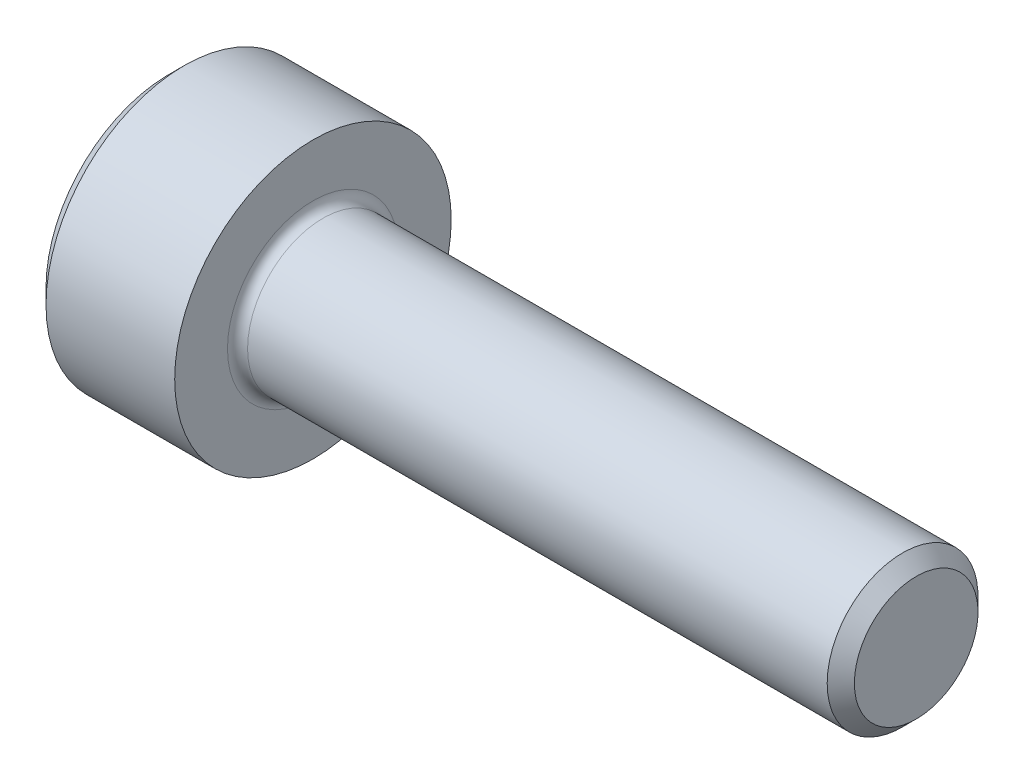
ISO-10303-21;
HEADER;
FILE_DESCRIPTION(('STEP AP214'),'2;1');
FILE_NAME('part.step','',(''),(''),'','','');
FILE_SCHEMA(('AUTOMOTIVE_DESIGN { 1 0 10303 214 1 1 1 1 }'));
ENDSEC;
DATA;
#1=APPLICATION_CONTEXT('core data for automotive mechanical design processes');
#2=APPLICATION_PROTOCOL_DEFINITION('international standard','automotive_design',2000,#1);
#3=PRODUCT_CONTEXT('',#1,'mechanical');
#4=PRODUCT('Part','Part','',(#3));
#5=PRODUCT_RELATED_PRODUCT_CATEGORY('part','',(#4));
#6=PRODUCT_DEFINITION_FORMATION('','',#4);
#7=PRODUCT_DEFINITION_CONTEXT('part definition',#1,'design');
#8=PRODUCT_DEFINITION('design','',#6,#7);
#9=PRODUCT_DEFINITION_SHAPE('','',#8);
#10=(LENGTH_UNIT() NAMED_UNIT(*) SI_UNIT(.MILLI.,.METRE.));
#11=(NAMED_UNIT(*) PLANE_ANGLE_UNIT() SI_UNIT($,.RADIAN.));
#12=(NAMED_UNIT(*) SI_UNIT($,.STERADIAN.) SOLID_ANGLE_UNIT());
#13=UNCERTAINTY_MEASURE_WITH_UNIT(LENGTH_MEASURE(1.E-05),#10,'distance_accuracy_value','');
#14=(GEOMETRIC_REPRESENTATION_CONTEXT(3) GLOBAL_UNCERTAINTY_ASSIGNED_CONTEXT((#13)) GLOBAL_UNIT_ASSIGNED_CONTEXT((#10,
#11,#12)) REPRESENTATION_CONTEXT('',''));
#15=CARTESIAN_POINT('',(0.,0.,0.));
#16=DIRECTION('',(0.,0.,1.));
#17=DIRECTION('',(1.,0.,0.));
#18=AXIS2_PLACEMENT_3D('',#15,#16,#17);
#19=CARTESIAN_POINT('',(-1.56,0.72168783648703,1.25));
#20=DIRECTION('',(1.,0.,0.));
#21=DIRECTION('',(0.,0.,-1.));
#22=AXIS2_PLACEMENT_3D('',#19,#20,#21);
#23=PLANE('',#22);
#24=CARTESIAN_POINT('',(-1.56,0.,0.));
#25=DIRECTION('',(-1.,0.,0.));
#26=DIRECTION('',(0.,0.,1.));
#27=AXIS2_PLACEMENT_3D('',#24,#25,#26);
#28=CIRCLE('',#27,1.25);
#29=CARTESIAN_POINT('',(-1.56,0.,1.25));
#30=VERTEX_POINT('',#29);
#31=CARTESIAN_POINT('',(-1.56,1.08253175473053,0.625000000000025));
#32=VERTEX_POINT('',#31);
#33=EDGE_CURVE('E42',#30,#32,#28,.T.);
#34=ORIENTED_EDGE('',*,*,#33,.F.);
#35=DIRECTION('',(0.,-1.,0.));
#36=VECTOR('',#35,1.);
#37=CARTESIAN_POINT('',(-1.56,0.72168783648703,1.25));
#38=LINE('',#37,#36);
#39=CARTESIAN_POINT('',(-1.56,0.72168783648703,1.25));
#40=VERTEX_POINT('',#39);
#41=EDGE_CURVE('E155',#40,#30,#38,.T.);
#42=ORIENTED_EDGE('',*,*,#41,.F.);
#43=DIRECTION('',(0.,-0.50000000000002,0.866025403784427));
#44=VECTOR('',#43,1.);
#45=CARTESIAN_POINT('',(-1.56,1.4433756729741,0.));
#46=LINE('',#45,#44);
#47=EDGE_CURVE('E191',#32,#40,#46,.T.);
#48=ORIENTED_EDGE('',*,*,#47,.F.);
#49=EDGE_LOOP('',(#34,#42,#48));
#50=FACE_BOUND('',#49,.T.);
#51=ADVANCED_FACE('F31',(#50),#23,.F.);
#52=CARTESIAN_POINT('',(-1.56,1.08253175473053,-0.625000000000025));
#53=VERTEX_POINT('',#52);
#54=EDGE_CURVE('E11',#32,#53,#28,.T.);
#55=ORIENTED_EDGE('',*,*,#54,.F.);
#56=CARTESIAN_POINT('',(-1.56,1.4433756729741,0.));
#57=VERTEX_POINT('',#56);
#58=EDGE_CURVE('E289',#57,#32,#46,.T.);
#59=ORIENTED_EDGE('',*,*,#58,.F.);
#60=DIRECTION('',(0.,0.50000000000002,0.866025403784427));
#61=VECTOR('',#60,1.);
#62=CARTESIAN_POINT('',(-1.56,0.72168783648703,-1.25));
#63=LINE('',#62,#61);
#64=EDGE_CURVE('E170',#53,#57,#63,.T.);
#65=ORIENTED_EDGE('',*,*,#64,.F.);
#66=EDGE_LOOP('',(#55,#59,#65));
#67=FACE_BOUND('',#66,.T.);
#68=ADVANCED_FACE('F119',(#67),#23,.F.);
#69=CARTESIAN_POINT('',(-1.56,0.,-1.25));
#70=VERTEX_POINT('',#69);
#71=EDGE_CURVE('E40',#53,#70,#28,.T.);
#72=ORIENTED_EDGE('',*,*,#71,.F.);
#73=CARTESIAN_POINT('',(-1.56,0.72168783648703,-1.25));
#74=VERTEX_POINT('',#73);
#75=EDGE_CURVE('E171',#74,#53,#63,.T.);
#76=ORIENTED_EDGE('',*,*,#75,.F.);
#77=DIRECTION('',(0.,1.,0.));
#78=VECTOR('',#77,1.);
#79=CARTESIAN_POINT('',(-1.56,-0.72168783648703,-1.25));
#80=LINE('',#79,#78);
#81=EDGE_CURVE('E166',#70,#74,#80,.T.);
#82=ORIENTED_EDGE('',*,*,#81,.F.);
#83=EDGE_LOOP('',(#72,#76,#82));
#84=FACE_BOUND('',#83,.T.);
#85=ADVANCED_FACE('F125',(#84),#23,.F.);
#86=CARTESIAN_POINT('',(-1.56,-1.08253175473053,-0.625000000000025));
#87=VERTEX_POINT('',#86);
#88=EDGE_CURVE('E279',#70,#87,#28,.T.);
#89=ORIENTED_EDGE('',*,*,#88,.F.);
#90=CARTESIAN_POINT('',(-1.56,-0.72168783648703,-1.25));
#91=VERTEX_POINT('',#90);
#92=EDGE_CURVE('E167',#91,#70,#80,.T.);
#93=ORIENTED_EDGE('',*,*,#92,.F.);
#94=DIRECTION('',(0.,0.50000000000002,-0.866025403784427));
#95=VECTOR('',#94,1.);
#96=CARTESIAN_POINT('',(-1.56,-1.4433756729741,0.));
#97=LINE('',#96,#95);
#98=EDGE_CURVE('E161',#87,#91,#97,.T.);
#99=ORIENTED_EDGE('',*,*,#98,.F.);
#100=EDGE_LOOP('',(#89,#93,#99));
#101=FACE_BOUND('',#100,.T.);
#102=ADVANCED_FACE('F138',(#101),#23,.F.);
#103=CARTESIAN_POINT('',(-1.56,-1.08253175473055,0.625000000000032));
#104=VERTEX_POINT('',#103);
#105=EDGE_CURVE('E49',#87,#104,#28,.T.);
#106=ORIENTED_EDGE('',*,*,#105,.F.);
#107=CARTESIAN_POINT('',(-1.56,-1.4433756729741,0.));
#108=VERTEX_POINT('',#107);
#109=EDGE_CURVE('E152',#108,#87,#97,.T.);
#110=ORIENTED_EDGE('',*,*,#109,.F.);
#111=DIRECTION('',(0.,-0.50000000000002,-0.866025403784427));
#112=VECTOR('',#111,1.);
#113=CARTESIAN_POINT('',(-1.56,-0.72168783648703,1.25));
#114=LINE('',#113,#112);
#115=EDGE_CURVE('E149',#104,#108,#114,.T.);
#116=ORIENTED_EDGE('',*,*,#115,.F.);
#117=EDGE_LOOP('',(#106,#110,#116));
#118=FACE_BOUND('',#117,.T.);
#119=ADVANCED_FACE('F130',(#118),#23,.F.);
#120=EDGE_CURVE('E142',#104,#30,#28,.T.);
#121=ORIENTED_EDGE('',*,*,#120,.F.);
#122=CARTESIAN_POINT('',(-1.56,-0.72168783648703,1.25));
#123=VERTEX_POINT('',#122);
#124=EDGE_CURVE('E145',#123,#104,#114,.T.);
#125=ORIENTED_EDGE('',*,*,#124,.F.);
#126=EDGE_CURVE('E146',#30,#123,#38,.T.);
#127=ORIENTED_EDGE('',*,*,#126,.F.);
#128=EDGE_LOOP('',(#121,#125,#127));
#129=FACE_BOUND('',#128,.T.);
#130=ADVANCED_FACE('F121',(#129),#23,.F.);
#131=CARTESIAN_POINT('',(-2.86,0.,0.));
#132=DIRECTION('',(1.,0.,0.));
#133=DIRECTION('',(0.,0.,-1.));
#134=AXIS2_PLACEMENT_3D('',#131,#132,#133);
#135=PLANE('',#134);
#136=CARTESIAN_POINT('',(-2.86,0.,0.));
#137=DIRECTION('',(-1.,0.,0.));
#138=DIRECTION('',(0.,0.,1.));
#139=AXIS2_PLACEMENT_3D('',#136,#137,#138);
#140=CIRCLE('',#139,2.45);
#141=CARTESIAN_POINT('',(-2.86,0.,2.45));
#142=VERTEX_POINT('',#141);
#143=EDGE_CURVE('E202',#142,#142,#140,.T.);
#144=ORIENTED_EDGE('',*,*,#143,.T.);
#145=EDGE_LOOP('',(#144));
#146=FACE_BOUND('',#145,.T.);
#147=DIRECTION('',(0.,-0.50000000000002,0.866025403784427));
#148=VECTOR('',#147,1.);
#149=CARTESIAN_POINT('',(-2.86,1.4433756729741,0.));
#150=LINE('',#149,#148);
#151=CARTESIAN_POINT('',(-2.86,1.4433756729741,0.));
#152=VERTEX_POINT('',#151);
#153=CARTESIAN_POINT('',(-2.86,0.72168783648703,1.25));
#154=VERTEX_POINT('',#153);
#155=EDGE_CURVE('E57',#152,#154,#150,.T.);
#156=ORIENTED_EDGE('',*,*,#155,.T.);
#157=DIRECTION('',(0.,-1.,0.));
#158=VECTOR('',#157,1.);
#159=CARTESIAN_POINT('',(-2.86,0.72168783648703,1.25));
#160=LINE('',#159,#158);
#161=CARTESIAN_POINT('',(-2.86,-0.72168783648703,1.25));
#162=VERTEX_POINT('',#161);
#163=EDGE_CURVE('E176',#154,#162,#160,.T.);
#164=ORIENTED_EDGE('',*,*,#163,.T.);
#165=DIRECTION('',(0.,-0.50000000000002,-0.866025403784427));
#166=VECTOR('',#165,1.);
#167=CARTESIAN_POINT('',(-2.86,-0.72168783648703,1.25));
#168=LINE('',#167,#166);
#169=CARTESIAN_POINT('',(-2.86,-1.4433756729741,0.));
#170=VERTEX_POINT('',#169);
#171=EDGE_CURVE('E179',#162,#170,#168,.T.);
#172=ORIENTED_EDGE('',*,*,#171,.T.);
#173=DIRECTION('',(0.,0.50000000000002,-0.866025403784427));
#174=VECTOR('',#173,1.);
#175=CARTESIAN_POINT('',(-2.86,-1.4433756729741,0.));
#176=LINE('',#175,#174);
#177=CARTESIAN_POINT('',(-2.86,-0.72168783648703,-1.25));
#178=VERTEX_POINT('',#177);
#179=EDGE_CURVE('E182',#170,#178,#176,.T.);
#180=ORIENTED_EDGE('',*,*,#179,.T.);
#181=DIRECTION('',(0.,1.,0.));
#182=VECTOR('',#181,1.);
#183=CARTESIAN_POINT('',(-2.86,-0.72168783648703,-1.25));
#184=LINE('',#183,#182);
#185=CARTESIAN_POINT('',(-2.86,0.72168783648703,-1.25));
#186=VERTEX_POINT('',#185);
#187=EDGE_CURVE('E185',#178,#186,#184,.T.);
#188=ORIENTED_EDGE('',*,*,#187,.T.);
#189=DIRECTION('',(0.,0.50000000000002,0.866025403784427));
#190=VECTOR('',#189,1.);
#191=CARTESIAN_POINT('',(-2.86,0.72168783648703,-1.25));
#192=LINE('',#191,#190);
#193=EDGE_CURVE('E188',#186,#152,#192,.T.);
#194=ORIENTED_EDGE('',*,*,#193,.T.);
#195=EDGE_LOOP('',(#156,#164,#172,#180,#188,#194));
#196=FACE_BOUND('',#195,.T.);
#197=ADVANCED_FACE('F129',(#146,#196),#135,.F.);
#198=CARTESIAN_POINT('',(12.,1.2295,0.));
#199=DIRECTION('',(-1.,0.,0.));
#200=DIRECTION('',(0.,0.,1.));
#201=AXIS2_PLACEMENT_3D('',#198,#199,#200);
#202=PLANE('',#201);
#203=CARTESIAN_POINT('',(12.,0.,0.));
#204=DIRECTION('',(-1.,0.,0.));
#205=DIRECTION('',(0.,0.,1.));
#206=AXIS2_PLACEMENT_3D('',#203,#204,#205);
#207=CIRCLE('',#206,1.2295);
#208=CARTESIAN_POINT('',(12.,0.,1.2295));
#209=VERTEX_POINT('',#208);
#210=EDGE_CURVE('E35',#209,#209,#207,.T.);
#211=ORIENTED_EDGE('',*,*,#210,.F.);
#212=EDGE_LOOP('',(#211));
#213=FACE_BOUND('',#212,.T.);
#214=ADVANCED_FACE('F33',(#213),#202,.F.);
#215=CARTESIAN_POINT('',(12.,0.,0.));
#216=DIRECTION('',(-1.,0.,0.));
#217=DIRECTION('',(0.,0.,1.));
#218=AXIS2_PLACEMENT_3D('',#215,#216,#217);
#219=CONICAL_SURFACE('',#218,1.2295,0.785398163397449);
#220=CARTESIAN_POINT('',(11.7295,0.,0.));
#221=DIRECTION('',(-1.,0.,0.));
#222=DIRECTION('',(0.,0.,1.));
#223=AXIS2_PLACEMENT_3D('',#220,#221,#222);
#224=CIRCLE('',#223,1.5);
#225=CARTESIAN_POINT('',(11.7295,0.,1.5));
#226=VERTEX_POINT('',#225);
#227=EDGE_CURVE('E216',#226,#226,#224,.T.);
#228=ORIENTED_EDGE('',*,*,#227,.F.);
#229=EDGE_LOOP('',(#228));
#230=FACE_BOUND('',#229,.T.);
#231=ORIENTED_EDGE('',*,*,#210,.T.);
#232=EDGE_LOOP('',(#231));
#233=FACE_BOUND('',#232,.T.);
#234=ADVANCED_FACE('F223',(#230,#233),#219,.T.);
#235=CARTESIAN_POINT('',(12.,0.,0.));
#236=DIRECTION('',(-1.,0.,0.));
#237=DIRECTION('',(0.,0.,1.));
#238=AXIS2_PLACEMENT_3D('',#235,#236,#237);
#239=CYLINDRICAL_SURFACE('',#238,1.5);
#240=CARTESIAN_POINT('',(0.200000000000001,0.,0.));
#241=DIRECTION('',(-1.,0.,0.));
#242=DIRECTION('',(0.,0.,1.));
#243=AXIS2_PLACEMENT_3D('',#240,#241,#242);
#244=CIRCLE('',#243,1.5);
#245=CARTESIAN_POINT('',(0.200000000000001,0.,1.5));
#246=VERTEX_POINT('',#245);
#247=EDGE_CURVE('E214',#246,#246,#244,.T.);
#248=ORIENTED_EDGE('',*,*,#247,.F.);
#249=EDGE_LOOP('',(#248));
#250=FACE_BOUND('',#249,.T.);
#251=ORIENTED_EDGE('',*,*,#227,.T.);
#252=EDGE_LOOP('',(#251));
#253=FACE_BOUND('',#252,.T.);
#254=ADVANCED_FACE('F229',(#250,#253),#239,.T.);
#255=CARTESIAN_POINT('',(0.200000000000017,0.,0.));
#256=DIRECTION('',(-1.,0.,0.));
#257=DIRECTION('',(0.,0.,1.));
#258=AXIS2_PLACEMENT_3D('',#255,#256,#257);
#259=TOROIDAL_SURFACE('',#258,1.70000000000002,0.200000000000017);
#260=CARTESIAN_POINT('',(0.,0.,0.));
#261=DIRECTION('',(-1.,0.,0.));
#262=DIRECTION('',(0.,0.,1.));
#263=AXIS2_PLACEMENT_3D('',#260,#261,#262);
#264=CIRCLE('',#263,1.7);
#265=CARTESIAN_POINT('',(0.,0.,1.7));
#266=VERTEX_POINT('',#265);
#267=EDGE_CURVE('E211',#266,#266,#264,.T.);
#268=ORIENTED_EDGE('',*,*,#267,.F.);
#269=EDGE_LOOP('',(#268));
#270=FACE_BOUND('',#269,.T.);
#271=ORIENTED_EDGE('',*,*,#247,.T.);
#272=EDGE_LOOP('',(#271));
#273=FACE_BOUND('',#272,.T.);
#274=ADVANCED_FACE('F234',(#270,#273),#259,.F.);
#275=CARTESIAN_POINT('',(0.,2.75,0.));
#276=DIRECTION('',(-1.,0.,0.));
#277=DIRECTION('',(0.,0.,1.));
#278=AXIS2_PLACEMENT_3D('',#275,#276,#277);
#279=PLANE('',#278);
#280=CARTESIAN_POINT('',(0.,0.,0.));
#281=DIRECTION('',(-1.,0.,0.));
#282=DIRECTION('',(0.,0.,1.));
#283=AXIS2_PLACEMENT_3D('',#280,#281,#282);
#284=CIRCLE('',#283,2.75);
#285=CARTESIAN_POINT('',(0.,0.,2.75));
#286=VERTEX_POINT('',#285);
#287=EDGE_CURVE('E208',#286,#286,#284,.T.);
#288=ORIENTED_EDGE('',*,*,#287,.F.);
#289=EDGE_LOOP('',(#288));
#290=FACE_BOUND('',#289,.T.);
#291=ORIENTED_EDGE('',*,*,#267,.T.);
#292=EDGE_LOOP('',(#291));
#293=FACE_BOUND('',#292,.T.);
#294=ADVANCED_FACE('F240',(#290,#293),#279,.F.);
#295=CARTESIAN_POINT('',(12.,0.,0.));
#296=DIRECTION('',(-1.,0.,0.));
#297=DIRECTION('',(0.,0.,1.));
#298=AXIS2_PLACEMENT_3D('',#295,#296,#297);
#299=CYLINDRICAL_SURFACE('',#298,2.75);
#300=CARTESIAN_POINT('',(-2.56,0.,0.));
#301=DIRECTION('',(-1.,0.,0.));
#302=DIRECTION('',(0.,0.,1.));
#303=AXIS2_PLACEMENT_3D('',#300,#301,#302);
#304=CIRCLE('',#303,2.75);
#305=CARTESIAN_POINT('',(-2.56,0.,2.75));
#306=VERTEX_POINT('',#305);
#307=EDGE_CURVE('E205',#306,#306,#304,.T.);
#308=ORIENTED_EDGE('',*,*,#307,.F.);
#309=EDGE_LOOP('',(#308));
#310=FACE_BOUND('',#309,.T.);
#311=ORIENTED_EDGE('',*,*,#287,.T.);
#312=EDGE_LOOP('',(#311));
#313=FACE_BOUND('',#312,.T.);
#314=ADVANCED_FACE('F244',(#310,#313),#299,.T.);
#315=CARTESIAN_POINT('',(-2.56,0.,0.));
#316=DIRECTION('',(1.,0.,0.));
#317=DIRECTION('',(0.,0.,-1.));
#318=AXIS2_PLACEMENT_3D('',#315,#316,#317);
#319=CONICAL_SURFACE('',#318,2.75,0.785398163397448);
#320=ORIENTED_EDGE('',*,*,#143,.F.);
#321=EDGE_LOOP('',(#320));
#322=FACE_BOUND('',#321,.T.);
#323=ORIENTED_EDGE('',*,*,#307,.T.);
#324=EDGE_LOOP('',(#323));
#325=FACE_BOUND('',#324,.T.);
#326=ADVANCED_FACE('F248',(#322,#325),#319,.T.);
#327=CARTESIAN_POINT('',(-1.56,1.4433756729741,0.));
#328=DIRECTION('',(0.,-0.866025403784427,-0.50000000000002));
#329=DIRECTION('',(0.,0.50000000000002,-0.866025403784427));
#330=AXIS2_PLACEMENT_3D('',#327,#328,#329);
#331=PLANE('',#330);
#332=ORIENTED_EDGE('',*,*,#155,.F.);
#333=DIRECTION('',(-1.,0.,0.));
#334=VECTOR('',#333,1.);
#335=CARTESIAN_POINT('',(-1.56,1.4433756729741,0.));
#336=LINE('',#335,#334);
#337=EDGE_CURVE('E174',#57,#152,#336,.T.);
#338=ORIENTED_EDGE('',*,*,#337,.F.);
#339=ORIENTED_EDGE('',*,*,#58,.T.);
#340=ORIENTED_EDGE('',*,*,#47,.T.);
#341=DIRECTION('',(-1.,0.,0.));
#342=VECTOR('',#341,1.);
#343=CARTESIAN_POINT('',(-1.56,0.72168783648703,1.25));
#344=LINE('',#343,#342);
#345=EDGE_CURVE('E200',#40,#154,#344,.T.);
#346=ORIENTED_EDGE('',*,*,#345,.T.);
#347=EDGE_LOOP('',(#332,#338,#339,#340,#346));
#348=FACE_BOUND('',#347,.T.);
#349=ADVANCED_FACE('F251',(#348),#331,.T.);
#350=CARTESIAN_POINT('',(-1.56,0.72168783648703,1.25));
#351=DIRECTION('',(0.,0.,-1.));
#352=DIRECTION('',(-1.,0.,0.));
#353=AXIS2_PLACEMENT_3D('',#350,#351,#352);
#354=PLANE('',#353);
#355=ORIENTED_EDGE('',*,*,#163,.F.);
#356=ORIENTED_EDGE('',*,*,#345,.F.);
#357=ORIENTED_EDGE('',*,*,#41,.T.);
#358=ORIENTED_EDGE('',*,*,#126,.T.);
#359=DIRECTION('',(-1.,0.,0.));
#360=VECTOR('',#359,1.);
#361=CARTESIAN_POINT('',(-1.56,-0.72168783648703,1.25));
#362=LINE('',#361,#360);
#363=EDGE_CURVE('E160',#123,#162,#362,.T.);
#364=ORIENTED_EDGE('',*,*,#363,.T.);
#365=EDGE_LOOP('',(#355,#356,#357,#358,#364));
#366=FACE_BOUND('',#365,.T.);
#367=ADVANCED_FACE('F256',(#366),#354,.T.);
#368=CARTESIAN_POINT('',(-1.56,-0.72168783648703,1.25));
#369=DIRECTION('',(0.,0.866025403784427,-0.50000000000002));
#370=DIRECTION('',(0.,0.50000000000002,0.866025403784427));
#371=AXIS2_PLACEMENT_3D('',#368,#369,#370);
#372=PLANE('',#371);
#373=ORIENTED_EDGE('',*,*,#171,.F.);
#374=ORIENTED_EDGE('',*,*,#363,.F.);
#375=ORIENTED_EDGE('',*,*,#124,.T.);
#376=ORIENTED_EDGE('',*,*,#115,.T.);
#377=DIRECTION('',(-1.,0.,0.));
#378=VECTOR('',#377,1.);
#379=CARTESIAN_POINT('',(-1.56,-1.4433756729741,0.));
#380=LINE('',#379,#378);
#381=EDGE_CURVE('E197',#108,#170,#380,.T.);
#382=ORIENTED_EDGE('',*,*,#381,.T.);
#383=EDGE_LOOP('',(#373,#374,#375,#376,#382));
#384=FACE_BOUND('',#383,.T.);
#385=ADVANCED_FACE('F159',(#384),#372,.T.);
#386=CARTESIAN_POINT('',(-1.56,-1.4433756729741,0.));
#387=DIRECTION('',(0.,0.866025403784427,0.50000000000002));
#388=DIRECTION('',(0.,-0.50000000000002,0.866025403784427));
#389=AXIS2_PLACEMENT_3D('',#386,#387,#388);
#390=PLANE('',#389);
#391=ORIENTED_EDGE('',*,*,#179,.F.);
#392=ORIENTED_EDGE('',*,*,#381,.F.);
#393=ORIENTED_EDGE('',*,*,#109,.T.);
#394=ORIENTED_EDGE('',*,*,#98,.T.);
#395=DIRECTION('',(-1.,0.,0.));
#396=VECTOR('',#395,1.);
#397=CARTESIAN_POINT('',(-1.56,-0.72168783648703,-1.25));
#398=LINE('',#397,#396);
#399=EDGE_CURVE('E195',#91,#178,#398,.T.);
#400=ORIENTED_EDGE('',*,*,#399,.T.);
#401=EDGE_LOOP('',(#391,#392,#393,#394,#400));
#402=FACE_BOUND('',#401,.T.);
#403=ADVANCED_FACE('F262',(#402),#390,.T.);
#404=CARTESIAN_POINT('',(-1.56,-0.72168783648703,-1.25));
#405=DIRECTION('',(0.,0.,1.));
#406=DIRECTION('',(1.,0.,0.));
#407=AXIS2_PLACEMENT_3D('',#404,#405,#406);
#408=PLANE('',#407);
#409=ORIENTED_EDGE('',*,*,#187,.F.);
#410=ORIENTED_EDGE('',*,*,#399,.F.);
#411=ORIENTED_EDGE('',*,*,#92,.T.);
#412=ORIENTED_EDGE('',*,*,#81,.T.);
#413=DIRECTION('',(-1.,0.,0.));
#414=VECTOR('',#413,1.);
#415=CARTESIAN_POINT('',(-1.56,0.72168783648703,-1.25));
#416=LINE('',#415,#414);
#417=EDGE_CURVE('E193',#74,#186,#416,.T.);
#418=ORIENTED_EDGE('',*,*,#417,.T.);
#419=EDGE_LOOP('',(#409,#410,#411,#412,#418));
#420=FACE_BOUND('',#419,.T.);
#421=ADVANCED_FACE('F114',(#420),#408,.T.);
#422=CARTESIAN_POINT('',(-1.56,0.72168783648703,-1.25));
#423=DIRECTION('',(0.,-0.866025403784427,0.50000000000002));
#424=DIRECTION('',(0.,-0.50000000000002,-0.866025403784427));
#425=AXIS2_PLACEMENT_3D('',#422,#423,#424);
#426=PLANE('',#425);
#427=ORIENTED_EDGE('',*,*,#193,.F.);
#428=ORIENTED_EDGE('',*,*,#417,.F.);
#429=ORIENTED_EDGE('',*,*,#75,.T.);
#430=ORIENTED_EDGE('',*,*,#64,.T.);
#431=ORIENTED_EDGE('',*,*,#337,.T.);
#432=EDGE_LOOP('',(#427,#428,#429,#430,#431));
#433=FACE_BOUND('',#432,.T.);
#434=ADVANCED_FACE('F109',(#433),#426,.T.);
#435=CARTESIAN_POINT('',(-0.83831216351297,0.,0.));
#436=DIRECTION('',(-1.,0.,0.));
#437=DIRECTION('',(0.,0.,1.));
#438=AXIS2_PLACEMENT_3D('',#435,#436,#437);
#439=CONICAL_SURFACE('',#438,0.,1.0471975511966);
#440=ORIENTED_EDGE('',*,*,#33,.T.);
#441=ORIENTED_EDGE('',*,*,#54,.T.);
#442=ORIENTED_EDGE('',*,*,#71,.T.);
#443=ORIENTED_EDGE('',*,*,#88,.T.);
#444=ORIENTED_EDGE('',*,*,#105,.T.);
#445=ORIENTED_EDGE('',*,*,#120,.T.);
#446=EDGE_LOOP('',(#440,#441,#442,#443,#444,#445));
#447=FACE_BOUND('',#446,.T.);
#448=CARTESIAN_POINT('',(-0.83831216351297,0.,0.));
#449=VERTEX_POINT('',#448);
#450=VERTEX_LOOP('',#449);
#451=FACE_BOUND('',#450,.T.);
#452=ADVANCED_FACE('F107',(#447,#451),#439,.F.);
#453=CLOSED_SHELL('',(#51,#68,#85,#102,#119,#130,#197,#214,#234,#254,#274,#294,#314,#326,#349,
#367,#385,#403,#421,#434,#452));
#454=MANIFOLD_SOLID_BREP('B2',#453);
#455=ADVANCED_BREP_SHAPE_REPRESENTATION('',(#18,#454),#14);
#456=SHAPE_DEFINITION_REPRESENTATION(#9,#455);
ENDSEC;
END-ISO-10303-21;
